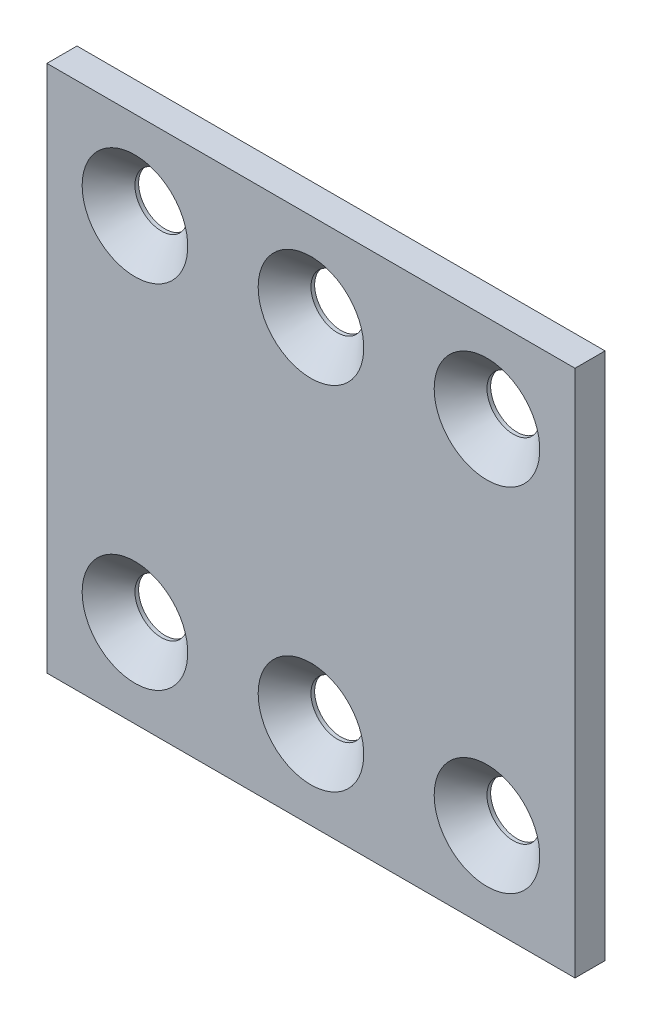
ISO-10303-21;
HEADER;
FILE_DESCRIPTION(('STEP AP214'),'2;1');
FILE_NAME('part.step','',(''),(''),'','','');
FILE_SCHEMA(('AUTOMOTIVE_DESIGN { 1 0 10303 214 1 1 1 1 }'));
ENDSEC;
DATA;
#1=APPLICATION_CONTEXT('core data for automotive mechanical design processes');
#2=APPLICATION_PROTOCOL_DEFINITION('international standard','automotive_design',2000,#1);
#3=PRODUCT_CONTEXT('',#1,'mechanical');
#4=PRODUCT('Part','Part','',(#3));
#5=PRODUCT_RELATED_PRODUCT_CATEGORY('part','',(#4));
#6=PRODUCT_DEFINITION_FORMATION('','',#4);
#7=PRODUCT_DEFINITION_CONTEXT('part definition',#1,'design');
#8=PRODUCT_DEFINITION('design','',#6,#7);
#9=PRODUCT_DEFINITION_SHAPE('','',#8);
#10=(LENGTH_UNIT() NAMED_UNIT(*) SI_UNIT(.MILLI.,.METRE.));
#11=(NAMED_UNIT(*) PLANE_ANGLE_UNIT() SI_UNIT($,.RADIAN.));
#12=(NAMED_UNIT(*) SI_UNIT($,.STERADIAN.) SOLID_ANGLE_UNIT());
#13=UNCERTAINTY_MEASURE_WITH_UNIT(LENGTH_MEASURE(1.E-05),#10,'distance_accuracy_value','');
#14=(GEOMETRIC_REPRESENTATION_CONTEXT(3) GLOBAL_UNCERTAINTY_ASSIGNED_CONTEXT((#13)) GLOBAL_UNIT_ASSIGNED_CONTEXT((#10,
#11,#12)) REPRESENTATION_CONTEXT('',''));
#15=CARTESIAN_POINT('',(0.,0.,0.));
#16=DIRECTION('',(0.,0.,1.));
#17=DIRECTION('',(1.,0.,0.));
#18=AXIS2_PLACEMENT_3D('',#15,#16,#17);
#19=CARTESIAN_POINT('',(30.,-30.,1.708));
#20=DIRECTION('',(-1.,0.,0.));
#21=DIRECTION('',(0.,0.,1.));
#22=AXIS2_PLACEMENT_3D('',#19,#20,#21);
#23=PLANE('',#22);
#24=DIRECTION('',(0.,1.,0.));
#25=VECTOR('',#24,1.);
#26=CARTESIAN_POINT('',(30.,-30.,-1.708));
#27=LINE('',#26,#25);
#28=CARTESIAN_POINT('',(30.,-30.,-1.708));
#29=VERTEX_POINT('',#28);
#30=CARTESIAN_POINT('',(30.,30.,-1.708));
#31=VERTEX_POINT('',#30);
#32=EDGE_CURVE('E119',#29,#31,#27,.T.);
#33=ORIENTED_EDGE('',*,*,#32,.T.);
#34=DIRECTION('',(0.,0.,-1.));
#35=VECTOR('',#34,1.);
#36=CARTESIAN_POINT('',(30.,30.,1.708));
#37=LINE('',#36,#35);
#38=CARTESIAN_POINT('',(30.,30.,1.708));
#39=VERTEX_POINT('',#38);
#40=EDGE_CURVE('E108',#39,#31,#37,.T.);
#41=ORIENTED_EDGE('',*,*,#40,.F.);
#42=DIRECTION('',(0.,1.,0.));
#43=VECTOR('',#42,1.);
#44=CARTESIAN_POINT('',(30.,-30.,1.708));
#45=LINE('',#44,#43);
#46=CARTESIAN_POINT('',(30.,-30.,1.708));
#47=VERTEX_POINT('',#46);
#48=EDGE_CURVE('E100',#47,#39,#45,.T.);
#49=ORIENTED_EDGE('',*,*,#48,.F.);
#50=DIRECTION('',(0.,0.,-1.));
#51=VECTOR('',#50,1.);
#52=CARTESIAN_POINT('',(30.,-30.,1.708));
#53=LINE('',#52,#51);
#54=EDGE_CURVE('E115',#47,#29,#53,.T.);
#55=ORIENTED_EDGE('',*,*,#54,.T.);
#56=EDGE_LOOP('',(#33,#41,#49,#55));
#57=FACE_BOUND('',#56,.T.);
#58=ADVANCED_FACE('F45',(#57),#23,.F.);
#59=CARTESIAN_POINT('',(-30.,30.,1.708));
#60=DIRECTION('',(0.,-1.,0.));
#61=DIRECTION('',(0.,0.,-1.));
#62=AXIS2_PLACEMENT_3D('',#59,#60,#61);
#63=PLANE('',#62);
#64=DIRECTION('',(-1.,0.,0.));
#65=VECTOR('',#64,1.);
#66=CARTESIAN_POINT('',(-30.,30.,-1.708));
#67=LINE('',#66,#65);
#68=CARTESIAN_POINT('',(-30.,30.,-1.708));
#69=VERTEX_POINT('',#68);
#70=EDGE_CURVE('E106',#31,#69,#67,.T.);
#71=ORIENTED_EDGE('',*,*,#70,.T.);
#72=DIRECTION('',(0.,0.,-1.));
#73=VECTOR('',#72,1.);
#74=CARTESIAN_POINT('',(-30.,30.,1.708));
#75=LINE('',#74,#73);
#76=CARTESIAN_POINT('',(-30.,30.,1.708));
#77=VERTEX_POINT('',#76);
#78=EDGE_CURVE('E104',#77,#69,#75,.T.);
#79=ORIENTED_EDGE('',*,*,#78,.F.);
#80=DIRECTION('',(-1.,0.,0.));
#81=VECTOR('',#80,1.);
#82=CARTESIAN_POINT('',(-30.,30.,1.708));
#83=LINE('',#82,#81);
#84=EDGE_CURVE('E95',#39,#77,#83,.T.);
#85=ORIENTED_EDGE('',*,*,#84,.F.);
#86=ORIENTED_EDGE('',*,*,#40,.T.);
#87=EDGE_LOOP('',(#71,#79,#85,#86));
#88=FACE_BOUND('',#87,.T.);
#89=ADVANCED_FACE('F105',(#88),#63,.F.);
#90=CARTESIAN_POINT('',(-30.,-30.,1.708));
#91=DIRECTION('',(1.,0.,0.));
#92=DIRECTION('',(0.,0.,-1.));
#93=AXIS2_PLACEMENT_3D('',#90,#91,#92);
#94=PLANE('',#93);
#95=DIRECTION('',(0.,-1.,0.));
#96=VECTOR('',#95,1.);
#97=CARTESIAN_POINT('',(-30.,-30.,-1.708));
#98=LINE('',#97,#96);
#99=CARTESIAN_POINT('',(-30.,-30.,-1.708));
#100=VERTEX_POINT('',#99);
#101=EDGE_CURVE('E81',#69,#100,#98,.T.);
#102=ORIENTED_EDGE('',*,*,#101,.T.);
#103=DIRECTION('',(0.,0.,-1.));
#104=VECTOR('',#103,1.);
#105=CARTESIAN_POINT('',(-30.,-30.,1.708));
#106=LINE('',#105,#104);
#107=CARTESIAN_POINT('',(-30.,-30.,1.708));
#108=VERTEX_POINT('',#107);
#109=EDGE_CURVE('E109',#108,#100,#106,.T.);
#110=ORIENTED_EDGE('',*,*,#109,.F.);
#111=DIRECTION('',(0.,-1.,0.));
#112=VECTOR('',#111,1.);
#113=CARTESIAN_POINT('',(-30.,-30.,1.708));
#114=LINE('',#113,#112);
#115=EDGE_CURVE('E98',#77,#108,#114,.T.);
#116=ORIENTED_EDGE('',*,*,#115,.F.);
#117=ORIENTED_EDGE('',*,*,#78,.T.);
#118=EDGE_LOOP('',(#102,#110,#116,#117));
#119=FACE_BOUND('',#118,.T.);
#120=ADVANCED_FACE('F111',(#119),#94,.F.);
#121=CARTESIAN_POINT('',(-30.,-30.,1.708));
#122=DIRECTION('',(0.,1.,0.));
#123=DIRECTION('',(0.,0.,1.));
#124=AXIS2_PLACEMENT_3D('',#121,#122,#123);
#125=PLANE('',#124);
#126=DIRECTION('',(1.,0.,0.));
#127=VECTOR('',#126,1.);
#128=CARTESIAN_POINT('',(-30.,-30.,-1.708));
#129=LINE('',#128,#127);
#130=EDGE_CURVE('E87',#100,#29,#129,.T.);
#131=ORIENTED_EDGE('',*,*,#130,.T.);
#132=ORIENTED_EDGE('',*,*,#54,.F.);
#133=DIRECTION('',(1.,0.,0.));
#134=VECTOR('',#133,1.);
#135=CARTESIAN_POINT('',(-30.,-30.,1.708));
#136=LINE('',#135,#134);
#137=EDGE_CURVE('E64',#108,#47,#136,.T.);
#138=ORIENTED_EDGE('',*,*,#137,.F.);
#139=ORIENTED_EDGE('',*,*,#109,.T.);
#140=EDGE_LOOP('',(#131,#132,#138,#139));
#141=FACE_BOUND('',#140,.T.);
#142=ADVANCED_FACE('F297',(#141),#125,.F.);
#143=CARTESIAN_POINT('',(0.,0.,1.708));
#144=DIRECTION('',(0.,0.,-1.));
#145=DIRECTION('',(-1.,0.,0.));
#146=AXIS2_PLACEMENT_3D('',#143,#144,#145);
#147=PLANE('',#146);
#148=CARTESIAN_POINT('',(20.,-20.,1.708));
#149=DIRECTION('',(0.,0.,-1.));
#150=DIRECTION('',(-1.,0.,0.));
#151=AXIS2_PLACEMENT_3D('',#148,#149,#150);
#152=CIRCLE('',#151,6.00000000000003);
#153=CARTESIAN_POINT('',(14.,-20.,1.708));
#154=VERTEX_POINT('',#153);
#155=EDGE_CURVE('E160',#154,#154,#152,.T.);
#156=ORIENTED_EDGE('',*,*,#155,.T.);
#157=EDGE_LOOP('',(#156));
#158=FACE_BOUND('',#157,.T.);
#159=CARTESIAN_POINT('',(0.,-20.,1.708));
#160=DIRECTION('',(0.,0.,-1.));
#161=DIRECTION('',(-1.,0.,0.));
#162=AXIS2_PLACEMENT_3D('',#159,#160,#161);
#163=CIRCLE('',#162,6.00000000000001);
#164=CARTESIAN_POINT('',(-6.00000000000001,-20.,1.708));
#165=VERTEX_POINT('',#164);
#166=EDGE_CURVE('E156',#165,#165,#163,.T.);
#167=ORIENTED_EDGE('',*,*,#166,.T.);
#168=EDGE_LOOP('',(#167));
#169=FACE_BOUND('',#168,.T.);
#170=CARTESIAN_POINT('',(-20.,-20.,1.708));
#171=DIRECTION('',(0.,0.,-1.));
#172=DIRECTION('',(-1.,0.,0.));
#173=AXIS2_PLACEMENT_3D('',#170,#171,#172);
#174=CIRCLE('',#173,6.00000000000001);
#175=CARTESIAN_POINT('',(-26.,-20.,1.708));
#176=VERTEX_POINT('',#175);
#177=EDGE_CURVE('E152',#176,#176,#174,.T.);
#178=ORIENTED_EDGE('',*,*,#177,.T.);
#179=EDGE_LOOP('',(#178));
#180=FACE_BOUND('',#179,.T.);
#181=CARTESIAN_POINT('',(20.,20.,1.708));
#182=DIRECTION('',(0.,0.,-1.));
#183=DIRECTION('',(-1.,0.,0.));
#184=AXIS2_PLACEMENT_3D('',#181,#182,#183);
#185=CIRCLE('',#184,6.00000000000001);
#186=CARTESIAN_POINT('',(14.,20.,1.708));
#187=VERTEX_POINT('',#186);
#188=EDGE_CURVE('E148',#187,#187,#185,.T.);
#189=ORIENTED_EDGE('',*,*,#188,.T.);
#190=EDGE_LOOP('',(#189));
#191=FACE_BOUND('',#190,.T.);
#192=CARTESIAN_POINT('',(0.,20.,1.708));
#193=DIRECTION('',(0.,0.,-1.));
#194=DIRECTION('',(-1.,0.,0.));
#195=AXIS2_PLACEMENT_3D('',#192,#193,#194);
#196=CIRCLE('',#195,6.00000000000001);
#197=CARTESIAN_POINT('',(-6.00000000000001,20.,1.708));
#198=VERTEX_POINT('',#197);
#199=EDGE_CURVE('E144',#198,#198,#196,.T.);
#200=ORIENTED_EDGE('',*,*,#199,.T.);
#201=EDGE_LOOP('',(#200));
#202=FACE_BOUND('',#201,.T.);
#203=CARTESIAN_POINT('',(-20.,20.,1.708));
#204=DIRECTION('',(0.,0.,-1.));
#205=DIRECTION('',(-1.,0.,0.));
#206=AXIS2_PLACEMENT_3D('',#203,#204,#205);
#207=CIRCLE('',#206,6.00000000000001);
#208=CARTESIAN_POINT('',(-26.,20.,1.708));
#209=VERTEX_POINT('',#208);
#210=EDGE_CURVE('E140',#209,#209,#207,.T.);
#211=ORIENTED_EDGE('',*,*,#210,.T.);
#212=EDGE_LOOP('',(#211));
#213=FACE_BOUND('',#212,.T.);
#214=ORIENTED_EDGE('',*,*,#48,.T.);
#215=ORIENTED_EDGE('',*,*,#84,.T.);
#216=ORIENTED_EDGE('',*,*,#115,.T.);
#217=ORIENTED_EDGE('',*,*,#137,.T.);
#218=EDGE_LOOP('',(#214,#215,#216,#217));
#219=FACE_BOUND('',#218,.T.);
#220=ADVANCED_FACE('F96',(#158,#169,#180,#191,#202,#213,#219),#147,.F.);
#221=CARTESIAN_POINT('',(0.,0.,-1.708));
#222=DIRECTION('',(0.,0.,-1.));
#223=DIRECTION('',(-1.,0.,0.));
#224=AXIS2_PLACEMENT_3D('',#221,#222,#223);
#225=PLANE('',#224);
#226=CARTESIAN_POINT('',(0.,-20.,-1.708));
#227=DIRECTION('',(0.,0.,1.));
#228=DIRECTION('',(1.,0.,0.));
#229=AXIS2_PLACEMENT_3D('',#226,#227,#228);
#230=CIRCLE('',#229,3.);
#231=CARTESIAN_POINT('',(3.,-20.,-1.708));
#232=VERTEX_POINT('',#231);
#233=EDGE_CURVE('E255',#232,#232,#230,.T.);
#234=ORIENTED_EDGE('',*,*,#233,.T.);
#235=EDGE_LOOP('',(#234));
#236=FACE_BOUND('',#235,.T.);
#237=CARTESIAN_POINT('',(20.,-20.,-1.708));
#238=DIRECTION('',(0.,0.,1.));
#239=DIRECTION('',(1.,0.,0.));
#240=AXIS2_PLACEMENT_3D('',#237,#238,#239);
#241=CIRCLE('',#240,3.);
#242=CARTESIAN_POINT('',(23.,-20.,-1.708));
#243=VERTEX_POINT('',#242);
#244=EDGE_CURVE('E249',#243,#243,#241,.T.);
#245=ORIENTED_EDGE('',*,*,#244,.T.);
#246=EDGE_LOOP('',(#245));
#247=FACE_BOUND('',#246,.T.);
#248=CARTESIAN_POINT('',(-20.,-20.,-1.708));
#249=DIRECTION('',(0.,0.,1.));
#250=DIRECTION('',(1.,0.,0.));
#251=AXIS2_PLACEMENT_3D('',#248,#249,#250);
#252=CIRCLE('',#251,2.99999999999999);
#253=CARTESIAN_POINT('',(-17.,-20.,-1.708));
#254=VERTEX_POINT('',#253);
#255=EDGE_CURVE('E246',#254,#254,#252,.T.);
#256=ORIENTED_EDGE('',*,*,#255,.T.);
#257=EDGE_LOOP('',(#256));
#258=FACE_BOUND('',#257,.T.);
#259=CARTESIAN_POINT('',(-20.,20.,-1.708));
#260=DIRECTION('',(0.,0.,1.));
#261=DIRECTION('',(1.,0.,0.));
#262=AXIS2_PLACEMENT_3D('',#259,#260,#261);
#263=CIRCLE('',#262,2.99999999999999);
#264=CARTESIAN_POINT('',(-17.,20.,-1.708));
#265=VERTEX_POINT('',#264);
#266=EDGE_CURVE('E250',#265,#265,#263,.T.);
#267=ORIENTED_EDGE('',*,*,#266,.T.);
#268=EDGE_LOOP('',(#267));
#269=FACE_BOUND('',#268,.T.);
#270=CARTESIAN_POINT('',(20.,20.,-1.708));
#271=DIRECTION('',(0.,0.,1.));
#272=DIRECTION('',(1.,0.,0.));
#273=AXIS2_PLACEMENT_3D('',#270,#271,#272);
#274=CIRCLE('',#273,2.99999999999999);
#275=CARTESIAN_POINT('',(23.,20.,-1.708));
#276=VERTEX_POINT('',#275);
#277=EDGE_CURVE('E258',#276,#276,#274,.T.);
#278=ORIENTED_EDGE('',*,*,#277,.T.);
#279=EDGE_LOOP('',(#278));
#280=FACE_BOUND('',#279,.T.);
#281=CARTESIAN_POINT('',(0.,20.,-1.708));
#282=DIRECTION('',(0.,0.,1.));
#283=DIRECTION('',(1.,0.,0.));
#284=AXIS2_PLACEMENT_3D('',#281,#282,#283);
#285=CIRCLE('',#284,3.);
#286=CARTESIAN_POINT('',(3.,20.,-1.708));
#287=VERTEX_POINT('',#286);
#288=EDGE_CURVE('E123',#287,#287,#285,.T.);
#289=ORIENTED_EDGE('',*,*,#288,.T.);
#290=EDGE_LOOP('',(#289));
#291=FACE_BOUND('',#290,.T.);
#292=ORIENTED_EDGE('',*,*,#32,.F.);
#293=ORIENTED_EDGE('',*,*,#130,.F.);
#294=ORIENTED_EDGE('',*,*,#101,.F.);
#295=ORIENTED_EDGE('',*,*,#70,.F.);
#296=EDGE_LOOP('',(#292,#293,#294,#295));
#297=FACE_BOUND('',#296,.T.);
#298=ADVANCED_FACE('F274',(#236,#247,#258,#269,#280,#291,#297),#225,.T.);
#299=CARTESIAN_POINT('',(0.,20.,-1.708));
#300=DIRECTION('',(0.,0.,1.));
#301=DIRECTION('',(1.,0.,0.));
#302=AXIS2_PLACEMENT_3D('',#299,#300,#301);
#303=CYLINDRICAL_SURFACE('',#302,3.);
#304=CARTESIAN_POINT('',(0.,20.,-1.29199999999999));
#305=DIRECTION('',(0.,0.,-1.));
#306=DIRECTION('',(-1.,0.,0.));
#307=AXIS2_PLACEMENT_3D('',#304,#305,#306);
#308=CIRCLE('',#307,3.);
#309=CARTESIAN_POINT('',(-3.,20.,-1.29199999999999));
#310=VERTEX_POINT('',#309);
#311=EDGE_CURVE('E56',#310,#310,#308,.F.);
#312=ORIENTED_EDGE('',*,*,#311,.T.);
#313=EDGE_LOOP('',(#312));
#314=FACE_BOUND('',#313,.T.);
#315=ORIENTED_EDGE('',*,*,#288,.F.);
#316=EDGE_LOOP('',(#315));
#317=FACE_BOUND('',#316,.T.);
#318=ADVANCED_FACE('F179',(#314,#317),#303,.F.);
#319=CARTESIAN_POINT('',(20.,20.,-1.708));
#320=DIRECTION('',(0.,0.,1.));
#321=DIRECTION('',(1.,0.,0.));
#322=AXIS2_PLACEMENT_3D('',#319,#320,#321);
#323=CYLINDRICAL_SURFACE('',#322,2.99999999999999);
#324=CARTESIAN_POINT('',(20.,20.,-1.292));
#325=DIRECTION('',(0.,0.,-1.));
#326=DIRECTION('',(-1.,0.,0.));
#327=AXIS2_PLACEMENT_3D('',#324,#325,#326);
#328=CIRCLE('',#327,2.99999999999999);
#329=CARTESIAN_POINT('',(17.,20.,-1.292));
#330=VERTEX_POINT('',#329);
#331=EDGE_CURVE('E172',#330,#330,#328,.F.);
#332=ORIENTED_EDGE('',*,*,#331,.T.);
#333=EDGE_LOOP('',(#332));
#334=FACE_BOUND('',#333,.T.);
#335=ORIENTED_EDGE('',*,*,#277,.F.);
#336=EDGE_LOOP('',(#335));
#337=FACE_BOUND('',#336,.T.);
#338=ADVANCED_FACE('F277',(#334,#337),#323,.F.);
#339=CARTESIAN_POINT('',(-20.,20.,-1.708));
#340=DIRECTION('',(0.,0.,1.));
#341=DIRECTION('',(1.,0.,0.));
#342=AXIS2_PLACEMENT_3D('',#339,#340,#341);
#343=CYLINDRICAL_SURFACE('',#342,2.99999999999999);
#344=CARTESIAN_POINT('',(-20.,20.,-1.292));
#345=DIRECTION('',(0.,0.,-1.));
#346=DIRECTION('',(-1.,0.,0.));
#347=AXIS2_PLACEMENT_3D('',#344,#345,#346);
#348=CIRCLE('',#347,2.99999999999999);
#349=CARTESIAN_POINT('',(-23.,20.,-1.292));
#350=VERTEX_POINT('',#349);
#351=EDGE_CURVE('E11',#350,#350,#348,.F.);
#352=ORIENTED_EDGE('',*,*,#351,.T.);
#353=EDGE_LOOP('',(#352));
#354=FACE_BOUND('',#353,.T.);
#355=ORIENTED_EDGE('',*,*,#266,.F.);
#356=EDGE_LOOP('',(#355));
#357=FACE_BOUND('',#356,.T.);
#358=ADVANCED_FACE('F242',(#354,#357),#343,.F.);
#359=CARTESIAN_POINT('',(-20.,-20.,-1.708));
#360=DIRECTION('',(0.,0.,1.));
#361=DIRECTION('',(1.,0.,0.));
#362=AXIS2_PLACEMENT_3D('',#359,#360,#361);
#363=CYLINDRICAL_SURFACE('',#362,2.99999999999999);
#364=CARTESIAN_POINT('',(-20.,-20.,-1.292));
#365=DIRECTION('',(0.,0.,-1.));
#366=DIRECTION('',(-1.,0.,0.));
#367=AXIS2_PLACEMENT_3D('',#364,#365,#366);
#368=CIRCLE('',#367,2.99999999999999);
#369=CARTESIAN_POINT('',(-23.,-20.,-1.292));
#370=VERTEX_POINT('',#369);
#371=EDGE_CURVE('E168',#370,#370,#368,.F.);
#372=ORIENTED_EDGE('',*,*,#371,.T.);
#373=EDGE_LOOP('',(#372));
#374=FACE_BOUND('',#373,.T.);
#375=ORIENTED_EDGE('',*,*,#255,.F.);
#376=EDGE_LOOP('',(#375));
#377=FACE_BOUND('',#376,.T.);
#378=ADVANCED_FACE('F238',(#374,#377),#363,.F.);
#379=CARTESIAN_POINT('',(20.,-20.,-1.708));
#380=DIRECTION('',(0.,0.,1.));
#381=DIRECTION('',(1.,0.,0.));
#382=AXIS2_PLACEMENT_3D('',#379,#380,#381);
#383=CYLINDRICAL_SURFACE('',#382,3.);
#384=CARTESIAN_POINT('',(20.,-20.,-1.29200000000002));
#385=DIRECTION('',(0.,0.,-1.));
#386=DIRECTION('',(-1.,0.,0.));
#387=AXIS2_PLACEMENT_3D('',#384,#385,#386);
#388=CIRCLE('',#387,3.);
#389=CARTESIAN_POINT('',(17.,-20.,-1.29200000000002));
#390=VERTEX_POINT('',#389);
#391=EDGE_CURVE('E136',#390,#390,#388,.F.);
#392=ORIENTED_EDGE('',*,*,#391,.T.);
#393=EDGE_LOOP('',(#392));
#394=FACE_BOUND('',#393,.T.);
#395=ORIENTED_EDGE('',*,*,#244,.F.);
#396=EDGE_LOOP('',(#395));
#397=FACE_BOUND('',#396,.T.);
#398=ADVANCED_FACE('F241',(#394,#397),#383,.F.);
#399=CARTESIAN_POINT('',(0.,-20.,-1.708));
#400=DIRECTION('',(0.,0.,1.));
#401=DIRECTION('',(1.,0.,0.));
#402=AXIS2_PLACEMENT_3D('',#399,#400,#401);
#403=CYLINDRICAL_SURFACE('',#402,3.);
#404=CARTESIAN_POINT('',(0.,-20.,-1.29199999999999));
#405=DIRECTION('',(0.,0.,-1.));
#406=DIRECTION('',(-1.,0.,0.));
#407=AXIS2_PLACEMENT_3D('',#404,#405,#406);
#408=CIRCLE('',#407,3.);
#409=CARTESIAN_POINT('',(-3.,-20.,-1.29199999999999));
#410=VERTEX_POINT('',#409);
#411=EDGE_CURVE('E164',#410,#410,#408,.F.);
#412=ORIENTED_EDGE('',*,*,#411,.T.);
#413=EDGE_LOOP('',(#412));
#414=FACE_BOUND('',#413,.T.);
#415=ORIENTED_EDGE('',*,*,#233,.F.);
#416=EDGE_LOOP('',(#415));
#417=FACE_BOUND('',#416,.T.);
#418=ADVANCED_FACE('F213',(#414,#417),#403,.F.);
#419=CARTESIAN_POINT('',(20.,-20.,-1.29200000000002));
#420=DIRECTION('',(0.,0.,1.));
#421=DIRECTION('',(1.,0.,0.));
#422=AXIS2_PLACEMENT_3D('',#419,#420,#421);
#423=CONICAL_SURFACE('',#422,3.,0.785398163397449);
#424=ORIENTED_EDGE('',*,*,#155,.F.);
#425=EDGE_LOOP('',(#424));
#426=FACE_BOUND('',#425,.T.);
#427=ORIENTED_EDGE('',*,*,#391,.F.);
#428=EDGE_LOOP('',(#427));
#429=FACE_BOUND('',#428,.T.);
#430=ADVANCED_FACE('F206',(#426,#429),#423,.F.);
#431=CARTESIAN_POINT('',(0.,-20.,-1.29199999999999));
#432=DIRECTION('',(0.,0.,1.));
#433=DIRECTION('',(1.,0.,0.));
#434=AXIS2_PLACEMENT_3D('',#431,#432,#433);
#435=CONICAL_SURFACE('',#434,3.,0.785398163397451);
#436=ORIENTED_EDGE('',*,*,#166,.F.);
#437=EDGE_LOOP('',(#436));
#438=FACE_BOUND('',#437,.T.);
#439=ORIENTED_EDGE('',*,*,#411,.F.);
#440=EDGE_LOOP('',(#439));
#441=FACE_BOUND('',#440,.T.);
#442=ADVANCED_FACE('F212',(#438,#441),#435,.F.);
#443=CARTESIAN_POINT('',(-20.,-20.,-1.292));
#444=DIRECTION('',(0.,0.,1.));
#445=DIRECTION('',(1.,0.,0.));
#446=AXIS2_PLACEMENT_3D('',#443,#444,#445);
#447=CONICAL_SURFACE('',#446,2.99999999999999,0.785398163397451);
#448=ORIENTED_EDGE('',*,*,#177,.F.);
#449=EDGE_LOOP('',(#448));
#450=FACE_BOUND('',#449,.T.);
#451=ORIENTED_EDGE('',*,*,#371,.F.);
#452=EDGE_LOOP('',(#451));
#453=FACE_BOUND('',#452,.T.);
#454=ADVANCED_FACE('F191',(#450,#453),#447,.F.);
#455=CARTESIAN_POINT('',(20.,20.,-1.292));
#456=DIRECTION('',(0.,0.,1.));
#457=DIRECTION('',(1.,0.,0.));
#458=AXIS2_PLACEMENT_3D('',#455,#456,#457);
#459=CONICAL_SURFACE('',#458,2.99999999999999,0.785398163397451);
#460=ORIENTED_EDGE('',*,*,#188,.F.);
#461=EDGE_LOOP('',(#460));
#462=FACE_BOUND('',#461,.T.);
#463=ORIENTED_EDGE('',*,*,#331,.F.);
#464=EDGE_LOOP('',(#463));
#465=FACE_BOUND('',#464,.T.);
#466=ADVANCED_FACE('F184',(#462,#465),#459,.F.);
#467=CARTESIAN_POINT('',(0.,20.,-1.29199999999999));
#468=DIRECTION('',(0.,0.,1.));
#469=DIRECTION('',(1.,0.,0.));
#470=AXIS2_PLACEMENT_3D('',#467,#468,#469);
#471=CONICAL_SURFACE('',#470,3.,0.785398163397451);
#472=ORIENTED_EDGE('',*,*,#199,.F.);
#473=EDGE_LOOP('',(#472));
#474=FACE_BOUND('',#473,.T.);
#475=ORIENTED_EDGE('',*,*,#311,.F.);
#476=EDGE_LOOP('',(#475));
#477=FACE_BOUND('',#476,.T.);
#478=ADVANCED_FACE('F182',(#474,#477),#471,.F.);
#479=CARTESIAN_POINT('',(-20.,20.,-1.292));
#480=DIRECTION('',(0.,0.,1.));
#481=DIRECTION('',(1.,0.,0.));
#482=AXIS2_PLACEMENT_3D('',#479,#480,#481);
#483=CONICAL_SURFACE('',#482,2.99999999999999,0.785398163397451);
#484=ORIENTED_EDGE('',*,*,#210,.F.);
#485=EDGE_LOOP('',(#484));
#486=FACE_BOUND('',#485,.T.);
#487=ORIENTED_EDGE('',*,*,#351,.F.);
#488=EDGE_LOOP('',(#487));
#489=FACE_BOUND('',#488,.T.);
#490=ADVANCED_FACE('F48',(#486,#489),#483,.F.);
#491=CLOSED_SHELL('',(#58,#89,#120,#142,#220,#298,#318,#338,#358,#378,#398,#418,#430,#442,#454,
#466,#478,#490));
#492=MANIFOLD_SOLID_BREP('B2',#491);
#493=ADVANCED_BREP_SHAPE_REPRESENTATION('',(#18,#492),#14);
#494=SHAPE_DEFINITION_REPRESENTATION(#9,#493);
ENDSEC;
END-ISO-10303-21;
